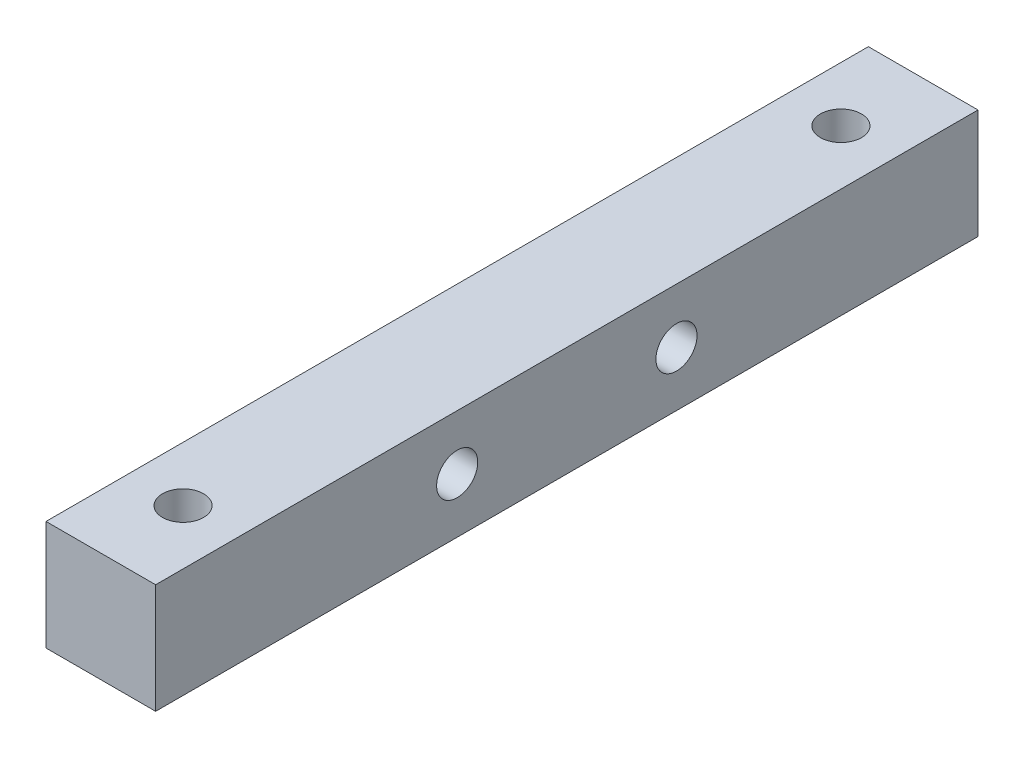
ISO-10303-21;
HEADER;
FILE_DESCRIPTION(('STEP AP214'),'2;1');
FILE_NAME('part.step','',(''),(''),'','','');
FILE_SCHEMA(('AUTOMOTIVE_DESIGN { 1 0 10303 214 1 1 1 1 }'));
ENDSEC;
DATA;
#1=APPLICATION_CONTEXT('core data for automotive mechanical design processes');
#2=APPLICATION_PROTOCOL_DEFINITION('international standard','automotive_design',2000,#1);
#3=PRODUCT_CONTEXT('',#1,'mechanical');
#4=PRODUCT('Part','Part','',(#3));
#5=PRODUCT_RELATED_PRODUCT_CATEGORY('part','',(#4));
#6=PRODUCT_DEFINITION_FORMATION('','',#4);
#7=PRODUCT_DEFINITION_CONTEXT('part definition',#1,'design');
#8=PRODUCT_DEFINITION('design','',#6,#7);
#9=PRODUCT_DEFINITION_SHAPE('','',#8);
#10=(LENGTH_UNIT() NAMED_UNIT(*) SI_UNIT(.MILLI.,.METRE.));
#11=(NAMED_UNIT(*) PLANE_ANGLE_UNIT() SI_UNIT($,.RADIAN.));
#12=(NAMED_UNIT(*) SI_UNIT($,.STERADIAN.) SOLID_ANGLE_UNIT());
#13=UNCERTAINTY_MEASURE_WITH_UNIT(LENGTH_MEASURE(1.E-05),#10,'distance_accuracy_value','');
#14=(GEOMETRIC_REPRESENTATION_CONTEXT(3) GLOBAL_UNCERTAINTY_ASSIGNED_CONTEXT((#13)) GLOBAL_UNIT_ASSIGNED_CONTEXT((#10,
#11,#12)) REPRESENTATION_CONTEXT('',''));
#15=CARTESIAN_POINT('',(0.,0.,0.));
#16=DIRECTION('',(0.,0.,1.));
#17=DIRECTION('',(1.,0.,0.));
#18=AXIS2_PLACEMENT_3D('',#15,#16,#17);
#19=CARTESIAN_POINT('',(-5.,0.,10.));
#20=DIRECTION('',(-1.,0.,0.));
#21=DIRECTION('',(0.,0.,1.));
#22=AXIS2_PLACEMENT_3D('',#19,#20,#21);
#23=CYLINDRICAL_SURFACE('',#22,1.87499999999999);
#24=CARTESIAN_POINT('',(5.,0.,10.));
#25=DIRECTION('',(-1.,0.,0.));
#26=DIRECTION('',(0.,0.,1.));
#27=AXIS2_PLACEMENT_3D('',#24,#25,#26);
#28=CIRCLE('',#27,1.875);
#29=CARTESIAN_POINT('',(5.,0.,11.875));
#30=VERTEX_POINT('',#29);
#31=EDGE_CURVE('E429',#30,#30,#28,.T.);
#32=ORIENTED_EDGE('',*,*,#31,.F.);
#33=EDGE_LOOP('',(#32));
#34=FACE_BOUND('',#33,.T.);
#35=CARTESIAN_POINT('',(-1.8,0.,10.));
#36=DIRECTION('',(-1.,0.,0.));
#37=DIRECTION('',(0.,0.,1.));
#38=AXIS2_PLACEMENT_3D('',#35,#36,#37);
#39=CIRCLE('',#38,1.87499999999999);
#40=CARTESIAN_POINT('',(-1.8,0.,11.875));
#41=VERTEX_POINT('',#40);
#42=EDGE_CURVE('E37',#41,#41,#39,.F.);
#43=ORIENTED_EDGE('',*,*,#42,.F.);
#44=EDGE_LOOP('',(#43));
#45=FACE_BOUND('',#44,.T.);
#46=ADVANCED_FACE('F33',(#34,#45),#23,.F.);
#47=CARTESIAN_POINT('',(-5.,0.,-10.));
#48=DIRECTION('',(-1.,0.,0.));
#49=DIRECTION('',(0.,0.,1.));
#50=AXIS2_PLACEMENT_3D('',#47,#48,#49);
#51=CYLINDRICAL_SURFACE('',#50,1.87499999999999);
#52=CARTESIAN_POINT('',(5.,0.,-10.));
#53=DIRECTION('',(-1.,0.,0.));
#54=DIRECTION('',(0.,0.,1.));
#55=AXIS2_PLACEMENT_3D('',#52,#53,#54);
#56=CIRCLE('',#55,1.875);
#57=CARTESIAN_POINT('',(5.,0.,-8.125));
#58=VERTEX_POINT('',#57);
#59=EDGE_CURVE('E426',#58,#58,#56,.T.);
#60=ORIENTED_EDGE('',*,*,#59,.F.);
#61=EDGE_LOOP('',(#60));
#62=FACE_BOUND('',#61,.T.);
#63=CARTESIAN_POINT('',(-1.8,0.,-10.));
#64=DIRECTION('',(-1.,0.,0.));
#65=DIRECTION('',(0.,0.,1.));
#66=AXIS2_PLACEMENT_3D('',#63,#64,#65);
#67=CIRCLE('',#66,1.87499999999999);
#68=CARTESIAN_POINT('',(-1.8,0.,-8.12500000000001));
#69=VERTEX_POINT('',#68);
#70=EDGE_CURVE('E312',#69,#69,#67,.F.);
#71=ORIENTED_EDGE('',*,*,#70,.F.);
#72=EDGE_LOOP('',(#71));
#73=FACE_BOUND('',#72,.T.);
#74=ADVANCED_FACE('F466',(#62,#73),#51,.F.);
#75=CARTESIAN_POINT('',(0.,-5.,30.));
#76=DIRECTION('',(0.,-1.,0.));
#77=DIRECTION('',(0.,0.,-1.));
#78=AXIS2_PLACEMENT_3D('',#75,#76,#77);
#79=CYLINDRICAL_SURFACE('',#78,1.87499999999999);
#80=CARTESIAN_POINT('',(0.,5.,30.));
#81=DIRECTION('',(0.,-1.,0.));
#82=DIRECTION('',(0.,0.,-1.));
#83=AXIS2_PLACEMENT_3D('',#80,#81,#82);
#84=CIRCLE('',#83,1.875);
#85=CARTESIAN_POINT('',(0.,5.,28.125));
#86=VERTEX_POINT('',#85);
#87=EDGE_CURVE('E423',#86,#86,#84,.T.);
#88=ORIENTED_EDGE('',*,*,#87,.F.);
#89=EDGE_LOOP('',(#88));
#90=FACE_BOUND('',#89,.T.);
#91=CARTESIAN_POINT('',(0.,-1.8,30.));
#92=DIRECTION('',(0.,-1.,0.));
#93=DIRECTION('',(0.,0.,-1.));
#94=AXIS2_PLACEMENT_3D('',#91,#92,#93);
#95=CIRCLE('',#94,1.87499999999999);
#96=CARTESIAN_POINT('',(0.,-1.8,28.125));
#97=VERTEX_POINT('',#96);
#98=EDGE_CURVE('E360',#97,#97,#95,.F.);
#99=ORIENTED_EDGE('',*,*,#98,.F.);
#100=EDGE_LOOP('',(#99));
#101=FACE_BOUND('',#100,.T.);
#102=ADVANCED_FACE('F468',(#90,#101),#79,.F.);
#103=CARTESIAN_POINT('',(0.,-5.,-30.));
#104=DIRECTION('',(0.,-1.,0.));
#105=DIRECTION('',(0.,0.,-1.));
#106=AXIS2_PLACEMENT_3D('',#103,#104,#105);
#107=CYLINDRICAL_SURFACE('',#106,1.87499999999999);
#108=CARTESIAN_POINT('',(0.,5.,-30.));
#109=DIRECTION('',(0.,-1.,0.));
#110=DIRECTION('',(0.,0.,-1.));
#111=AXIS2_PLACEMENT_3D('',#108,#109,#110);
#112=CIRCLE('',#111,1.875);
#113=CARTESIAN_POINT('',(0.,5.,-31.875));
#114=VERTEX_POINT('',#113);
#115=EDGE_CURVE('E420',#114,#114,#112,.T.);
#116=ORIENTED_EDGE('',*,*,#115,.F.);
#117=EDGE_LOOP('',(#116));
#118=FACE_BOUND('',#117,.T.);
#119=CARTESIAN_POINT('',(0.,-1.8,-30.));
#120=DIRECTION('',(0.,-1.,0.));
#121=DIRECTION('',(0.,0.,-1.));
#122=AXIS2_PLACEMENT_3D('',#119,#120,#121);
#123=CIRCLE('',#122,1.87499999999999);
#124=CARTESIAN_POINT('',(0.,-1.8,-31.875));
#125=VERTEX_POINT('',#124);
#126=EDGE_CURVE('E409',#125,#125,#123,.F.);
#127=ORIENTED_EDGE('',*,*,#126,.F.);
#128=EDGE_LOOP('',(#127));
#129=FACE_BOUND('',#128,.T.);
#130=ADVANCED_FACE('F475',(#118,#129),#107,.F.);
#131=CARTESIAN_POINT('',(5.,5.,37.5));
#132=DIRECTION('',(-1.,0.,0.));
#133=DIRECTION('',(0.,0.,1.));
#134=AXIS2_PLACEMENT_3D('',#131,#132,#133);
#135=PLANE('',#134);
#136=ORIENTED_EDGE('',*,*,#59,.T.);
#137=EDGE_LOOP('',(#136));
#138=FACE_BOUND('',#137,.T.);
#139=ORIENTED_EDGE('',*,*,#31,.T.);
#140=EDGE_LOOP('',(#139));
#141=FACE_BOUND('',#140,.T.);
#142=DIRECTION('',(0.,1.,0.));
#143=VECTOR('',#142,1.);
#144=CARTESIAN_POINT('',(5.,5.,-37.5));
#145=LINE('',#144,#143);
#146=CARTESIAN_POINT('',(5.,-5.,-37.5));
#147=VERTEX_POINT('',#146);
#148=CARTESIAN_POINT('',(5.,5.,-37.5));
#149=VERTEX_POINT('',#148);
#150=EDGE_CURVE('E432',#147,#149,#145,.T.);
#151=ORIENTED_EDGE('',*,*,#150,.T.);
#152=DIRECTION('',(0.,0.,-1.));
#153=VECTOR('',#152,1.);
#154=CARTESIAN_POINT('',(5.,5.,37.5));
#155=LINE('',#154,#153);
#156=CARTESIAN_POINT('',(5.,5.,37.5));
#157=VERTEX_POINT('',#156);
#158=EDGE_CURVE('E11',#157,#149,#155,.T.);
#159=ORIENTED_EDGE('',*,*,#158,.F.);
#160=DIRECTION('',(0.,1.,0.));
#161=VECTOR('',#160,1.);
#162=CARTESIAN_POINT('',(5.,5.,37.5));
#163=LINE('',#162,#161);
#164=CARTESIAN_POINT('',(5.,-5.,37.5));
#165=VERTEX_POINT('',#164);
#166=EDGE_CURVE('E433',#165,#157,#163,.T.);
#167=ORIENTED_EDGE('',*,*,#166,.F.);
#168=DIRECTION('',(0.,0.,-1.));
#169=VECTOR('',#168,1.);
#170=CARTESIAN_POINT('',(5.,-5.,37.5));
#171=LINE('',#170,#169);
#172=EDGE_CURVE('E443',#165,#147,#171,.T.);
#173=ORIENTED_EDGE('',*,*,#172,.T.);
#174=EDGE_LOOP('',(#151,#159,#167,#173));
#175=FACE_BOUND('',#174,.T.);
#176=ADVANCED_FACE('F35',(#138,#141,#175),#135,.F.);
#177=CARTESIAN_POINT('',(-5.,5.,37.5));
#178=DIRECTION('',(0.,-1.,0.));
#179=DIRECTION('',(0.,0.,-1.));
#180=AXIS2_PLACEMENT_3D('',#177,#178,#179);
#181=PLANE('',#180);
#182=ORIENTED_EDGE('',*,*,#115,.T.);
#183=EDGE_LOOP('',(#182));
#184=FACE_BOUND('',#183,.T.);
#185=ORIENTED_EDGE('',*,*,#87,.T.);
#186=EDGE_LOOP('',(#185));
#187=FACE_BOUND('',#186,.T.);
#188=DIRECTION('',(-1.,0.,0.));
#189=VECTOR('',#188,1.);
#190=CARTESIAN_POINT('',(-5.,5.,-37.5));
#191=LINE('',#190,#189);
#192=CARTESIAN_POINT('',(-5.,5.,-37.5));
#193=VERTEX_POINT('',#192);
#194=EDGE_CURVE('E446',#149,#193,#191,.T.);
#195=ORIENTED_EDGE('',*,*,#194,.T.);
#196=DIRECTION('',(0.,0.,-1.));
#197=VECTOR('',#196,1.);
#198=CARTESIAN_POINT('',(-5.,5.,37.5));
#199=LINE('',#198,#197);
#200=CARTESIAN_POINT('',(-5.,5.,37.5));
#201=VERTEX_POINT('',#200);
#202=EDGE_CURVE('E42',#201,#193,#199,.T.);
#203=ORIENTED_EDGE('',*,*,#202,.F.);
#204=DIRECTION('',(-1.,0.,0.));
#205=VECTOR('',#204,1.);
#206=CARTESIAN_POINT('',(-5.,5.,37.5));
#207=LINE('',#206,#205);
#208=EDGE_CURVE('E436',#157,#201,#207,.T.);
#209=ORIENTED_EDGE('',*,*,#208,.F.);
#210=ORIENTED_EDGE('',*,*,#158,.T.);
#211=EDGE_LOOP('',(#195,#203,#209,#210));
#212=FACE_BOUND('',#211,.T.);
#213=ADVANCED_FACE('F498',(#184,#187,#212),#181,.F.);
#214=CARTESIAN_POINT('',(-5.,5.,37.5));
#215=DIRECTION('',(1.,0.,0.));
#216=DIRECTION('',(0.,1.,0.));
#217=AXIS2_PLACEMENT_3D('',#214,#215,#216);
#218=PLANE('',#217);
#219=DIRECTION('',(0.,0.866025403784438,0.500000000000001));
#220=VECTOR('',#219,1.);
#221=CARTESIAN_POINT('',(-5.,-2.77128129211021,11.6));
#222=LINE('',#221,#220);
#223=CARTESIAN_POINT('',(-5.,-2.77128129211021,11.6));
#224=VERTEX_POINT('',#223);
#225=CARTESIAN_POINT('',(-5.,0.,13.2));
#226=VERTEX_POINT('',#225);
#227=EDGE_CURVE('E256',#224,#226,#222,.T.);
#228=ORIENTED_EDGE('',*,*,#227,.F.);
#229=DIRECTION('',(0.,0.,1.));
#230=VECTOR('',#229,1.);
#231=CARTESIAN_POINT('',(-5.,-2.77128129211021,8.4));
#232=LINE('',#231,#230);
#233=CARTESIAN_POINT('',(-5.,-2.77128129211021,8.4));
#234=VERTEX_POINT('',#233);
#235=EDGE_CURVE('E50',#234,#224,#232,.T.);
#236=ORIENTED_EDGE('',*,*,#235,.F.);
#237=DIRECTION('',(0.,-0.866025403784439,0.5));
#238=VECTOR('',#237,1.);
#239=CARTESIAN_POINT('',(-5.,0.,6.8));
#240=LINE('',#239,#238);
#241=CARTESIAN_POINT('',(-5.,0.,6.8));
#242=VERTEX_POINT('',#241);
#243=EDGE_CURVE('E242',#242,#234,#240,.T.);
#244=ORIENTED_EDGE('',*,*,#243,.F.);
#245=DIRECTION('',(0.,-0.866025403784439,-0.5));
#246=VECTOR('',#245,1.);
#247=CARTESIAN_POINT('',(-5.,2.7712812921102,8.4));
#248=LINE('',#247,#246);
#249=CARTESIAN_POINT('',(-5.,2.7712812921102,8.4));
#250=VERTEX_POINT('',#249);
#251=EDGE_CURVE('E245',#250,#242,#248,.T.);
#252=ORIENTED_EDGE('',*,*,#251,.F.);
#253=DIRECTION('',(0.,0.,-1.));
#254=VECTOR('',#253,1.);
#255=CARTESIAN_POINT('',(-5.,2.7712812921102,11.6));
#256=LINE('',#255,#254);
#257=CARTESIAN_POINT('',(-5.,2.7712812921102,11.6));
#258=VERTEX_POINT('',#257);
#259=EDGE_CURVE('E261',#258,#250,#256,.T.);
#260=ORIENTED_EDGE('',*,*,#259,.F.);
#261=DIRECTION('',(0.,0.866025403784439,-0.5));
#262=VECTOR('',#261,1.);
#263=CARTESIAN_POINT('',(-5.,0.,13.2));
#264=LINE('',#263,#262);
#265=EDGE_CURVE('E258',#226,#258,#264,.T.);
#266=ORIENTED_EDGE('',*,*,#265,.F.);
#267=EDGE_LOOP('',(#228,#236,#244,#252,#260,#266));
#268=FACE_BOUND('',#267,.T.);
#269=DIRECTION('',(0.,0.866025403784438,0.5));
#270=VECTOR('',#269,1.);
#271=CARTESIAN_POINT('',(-5.,-2.77128129211021,-8.4));
#272=LINE('',#271,#270);
#273=CARTESIAN_POINT('',(-5.,-2.77128129211021,-8.4));
#274=VERTEX_POINT('',#273);
#275=CARTESIAN_POINT('',(-5.,0.,-6.8));
#276=VERTEX_POINT('',#275);
#277=EDGE_CURVE('E296',#274,#276,#272,.T.);
#278=ORIENTED_EDGE('',*,*,#277,.F.);
#279=DIRECTION('',(0.,0.,1.));
#280=VECTOR('',#279,1.);
#281=CARTESIAN_POINT('',(-5.,-2.77128129211021,-11.6));
#282=LINE('',#281,#280);
#283=CARTESIAN_POINT('',(-5.,-2.77128129211021,-11.6));
#284=VERTEX_POINT('',#283);
#285=EDGE_CURVE('E58',#284,#274,#282,.T.);
#286=ORIENTED_EDGE('',*,*,#285,.F.);
#287=DIRECTION('',(0.,-0.866025403784438,0.500000000000001));
#288=VECTOR('',#287,1.);
#289=CARTESIAN_POINT('',(-5.,0.,-13.2));
#290=LINE('',#289,#288);
#291=CARTESIAN_POINT('',(-5.,0.,-13.2));
#292=VERTEX_POINT('',#291);
#293=EDGE_CURVE('E279',#292,#284,#290,.T.);
#294=ORIENTED_EDGE('',*,*,#293,.F.);
#295=DIRECTION('',(0.,-0.866025403784438,-0.500000000000001));
#296=VECTOR('',#295,1.);
#297=CARTESIAN_POINT('',(-5.,2.7712812921102,-11.6));
#298=LINE('',#297,#296);
#299=CARTESIAN_POINT('',(-5.,2.7712812921102,-11.6));
#300=VERTEX_POINT('',#299);
#301=EDGE_CURVE('E305',#300,#292,#298,.T.);
#302=ORIENTED_EDGE('',*,*,#301,.F.);
#303=DIRECTION('',(0.,0.,-1.));
#304=VECTOR('',#303,1.);
#305=CARTESIAN_POINT('',(-5.,2.7712812921102,-8.4));
#306=LINE('',#305,#304);
#307=CARTESIAN_POINT('',(-5.,2.7712812921102,-8.4));
#308=VERTEX_POINT('',#307);
#309=EDGE_CURVE('E302',#308,#300,#306,.T.);
#310=ORIENTED_EDGE('',*,*,#309,.F.);
#311=DIRECTION('',(0.,0.866025403784439,-0.5));
#312=VECTOR('',#311,1.);
#313=CARTESIAN_POINT('',(-5.,0.,-6.8));
#314=LINE('',#313,#312);
#315=EDGE_CURVE('E299',#276,#308,#314,.T.);
#316=ORIENTED_EDGE('',*,*,#315,.F.);
#317=EDGE_LOOP('',(#278,#286,#294,#302,#310,#316));
#318=FACE_BOUND('',#317,.T.);
#319=DIRECTION('',(0.,-1.,0.));
#320=VECTOR('',#319,1.);
#321=CARTESIAN_POINT('',(-5.,5.,-37.5));
#322=LINE('',#321,#320);
#323=CARTESIAN_POINT('',(-5.,-5.,-37.5));
#324=VERTEX_POINT('',#323);
#325=EDGE_CURVE('E448',#193,#324,#322,.T.);
#326=ORIENTED_EDGE('',*,*,#325,.T.);
#327=DIRECTION('',(0.,0.,-1.));
#328=VECTOR('',#327,1.);
#329=CARTESIAN_POINT('',(-5.,-5.,37.5));
#330=LINE('',#329,#328);
#331=CARTESIAN_POINT('',(-5.,-5.,37.5));
#332=VERTEX_POINT('',#331);
#333=EDGE_CURVE('E453',#332,#324,#330,.T.);
#334=ORIENTED_EDGE('',*,*,#333,.F.);
#335=DIRECTION('',(0.,-1.,0.));
#336=VECTOR('',#335,1.);
#337=CARTESIAN_POINT('',(-5.,5.,37.5));
#338=LINE('',#337,#336);
#339=EDGE_CURVE('E439',#201,#332,#338,.T.);
#340=ORIENTED_EDGE('',*,*,#339,.F.);
#341=ORIENTED_EDGE('',*,*,#202,.T.);
#342=EDGE_LOOP('',(#326,#334,#340,#341));
#343=FACE_BOUND('',#342,.T.);
#344=ADVANCED_FACE('F495',(#268,#318,#343),#218,.F.);
#345=CARTESIAN_POINT('',(-5.,-5.,37.5));
#346=DIRECTION('',(0.,1.,0.));
#347=DIRECTION('',(0.,0.,1.));
#348=AXIS2_PLACEMENT_3D('',#345,#346,#347);
#349=PLANE('',#348);
#350=DIRECTION('',(-0.866025403784438,0.,0.5));
#351=VECTOR('',#350,1.);
#352=CARTESIAN_POINT('',(2.7712812921102,-5.,31.6));
#353=LINE('',#352,#351);
#354=CARTESIAN_POINT('',(2.7712812921102,-5.,31.6));
#355=VERTEX_POINT('',#354);
#356=CARTESIAN_POINT('',(0.,-5.,33.2));
#357=VERTEX_POINT('',#356);
#358=EDGE_CURVE('E344',#355,#357,#353,.T.);
#359=ORIENTED_EDGE('',*,*,#358,.F.);
#360=DIRECTION('',(0.,0.,1.));
#361=VECTOR('',#360,1.);
#362=CARTESIAN_POINT('',(2.7712812921102,-5.,28.4));
#363=LINE('',#362,#361);
#364=CARTESIAN_POINT('',(2.7712812921102,-5.,28.4));
#365=VERTEX_POINT('',#364);
#366=EDGE_CURVE('E342',#365,#355,#363,.T.);
#367=ORIENTED_EDGE('',*,*,#366,.F.);
#368=DIRECTION('',(0.86602540378444,0.,0.499999999999998));
#369=VECTOR('',#368,1.);
#370=CARTESIAN_POINT('',(0.,-5.,26.8));
#371=LINE('',#370,#369);
#372=CARTESIAN_POINT('',(0.,-5.,26.8));
#373=VERTEX_POINT('',#372);
#374=EDGE_CURVE('E326',#373,#365,#371,.T.);
#375=ORIENTED_EDGE('',*,*,#374,.F.);
#376=DIRECTION('',(0.866025403784439,0.,-0.499999999999999));
#377=VECTOR('',#376,1.);
#378=CARTESIAN_POINT('',(-2.77128129211022,-5.,28.4));
#379=LINE('',#378,#377);
#380=CARTESIAN_POINT('',(-2.77128129211022,-5.,28.4));
#381=VERTEX_POINT('',#380);
#382=EDGE_CURVE('E353',#381,#373,#379,.T.);
#383=ORIENTED_EDGE('',*,*,#382,.F.);
#384=DIRECTION('',(0.,0.,-1.));
#385=VECTOR('',#384,1.);
#386=CARTESIAN_POINT('',(-2.77128129211021,-5.,31.6));
#387=LINE('',#386,#385);
#388=CARTESIAN_POINT('',(-2.77128129211021,-5.,31.6));
#389=VERTEX_POINT('',#388);
#390=EDGE_CURVE('E350',#389,#381,#387,.T.);
#391=ORIENTED_EDGE('',*,*,#390,.F.);
#392=DIRECTION('',(-0.866025403784438,0.,-0.500000000000002));
#393=VECTOR('',#392,1.);
#394=CARTESIAN_POINT('',(0.,-5.,33.2));
#395=LINE('',#394,#393);
#396=EDGE_CURVE('E347',#357,#389,#395,.T.);
#397=ORIENTED_EDGE('',*,*,#396,.F.);
#398=EDGE_LOOP('',(#359,#367,#375,#383,#391,#397));
#399=FACE_BOUND('',#398,.T.);
#400=DIRECTION('',(-0.866025403784438,0.,0.5));
#401=VECTOR('',#400,1.);
#402=CARTESIAN_POINT('',(2.77128129211021,-5.,-28.4));
#403=LINE('',#402,#401);
#404=CARTESIAN_POINT('',(2.77128129211021,-5.,-28.4));
#405=VERTEX_POINT('',#404);
#406=CARTESIAN_POINT('',(0.,-5.,-26.8));
#407=VERTEX_POINT('',#406);
#408=EDGE_CURVE('E393',#405,#407,#403,.T.);
#409=ORIENTED_EDGE('',*,*,#408,.F.);
#410=DIRECTION('',(0.,0.,1.));
#411=VECTOR('',#410,1.);
#412=CARTESIAN_POINT('',(2.77128129211021,-5.,-31.6));
#413=LINE('',#412,#411);
#414=CARTESIAN_POINT('',(2.77128129211021,-5.,-31.6));
#415=VERTEX_POINT('',#414);
#416=EDGE_CURVE('E391',#415,#405,#413,.T.);
#417=ORIENTED_EDGE('',*,*,#416,.F.);
#418=DIRECTION('',(0.866025403784438,0.,0.500000000000001));
#419=VECTOR('',#418,1.);
#420=CARTESIAN_POINT('',(0.,-5.,-33.2));
#421=LINE('',#420,#419);
#422=CARTESIAN_POINT('',(0.,-5.,-33.2));
#423=VERTEX_POINT('',#422);
#424=EDGE_CURVE('E375',#423,#415,#421,.T.);
#425=ORIENTED_EDGE('',*,*,#424,.F.);
#426=DIRECTION('',(0.866025403784438,0.,-0.5));
#427=VECTOR('',#426,1.);
#428=CARTESIAN_POINT('',(-2.77128129211019,-5.,-31.6));
#429=LINE('',#428,#427);
#430=CARTESIAN_POINT('',(-2.77128129211019,-5.,-31.6));
#431=VERTEX_POINT('',#430);
#432=EDGE_CURVE('E402',#431,#423,#429,.T.);
#433=ORIENTED_EDGE('',*,*,#432,.F.);
#434=DIRECTION('',(0.,0.,-1.));
#435=VECTOR('',#434,1.);
#436=CARTESIAN_POINT('',(-2.77128129211019,-5.,-28.4));
#437=LINE('',#436,#435);
#438=CARTESIAN_POINT('',(-2.77128129211019,-5.,-28.4));
#439=VERTEX_POINT('',#438);
#440=EDGE_CURVE('E399',#439,#431,#437,.T.);
#441=ORIENTED_EDGE('',*,*,#440,.F.);
#442=DIRECTION('',(-0.866025403784439,0.,-0.5));
#443=VECTOR('',#442,1.);
#444=CARTESIAN_POINT('',(0.,-5.,-26.8));
#445=LINE('',#444,#443);
#446=EDGE_CURVE('E396',#407,#439,#445,.T.);
#447=ORIENTED_EDGE('',*,*,#446,.F.);
#448=EDGE_LOOP('',(#409,#417,#425,#433,#441,#447));
#449=FACE_BOUND('',#448,.T.);
#450=DIRECTION('',(1.,0.,0.));
#451=VECTOR('',#450,1.);
#452=CARTESIAN_POINT('',(-5.,-5.,-37.5));
#453=LINE('',#452,#451);
#454=EDGE_CURVE('E437',#324,#147,#453,.T.);
#455=ORIENTED_EDGE('',*,*,#454,.T.);
#456=ORIENTED_EDGE('',*,*,#172,.F.);
#457=DIRECTION('',(1.,0.,0.));
#458=VECTOR('',#457,1.);
#459=CARTESIAN_POINT('',(-5.,-5.,37.5));
#460=LINE('',#459,#458);
#461=EDGE_CURVE('E441',#332,#165,#460,.T.);
#462=ORIENTED_EDGE('',*,*,#461,.F.);
#463=ORIENTED_EDGE('',*,*,#333,.T.);
#464=EDGE_LOOP('',(#455,#456,#462,#463));
#465=FACE_BOUND('',#464,.T.);
#466=ADVANCED_FACE('F487',(#399,#449,#465),#349,.F.);
#467=CARTESIAN_POINT('',(0.,0.,37.5));
#468=DIRECTION('',(0.,0.,1.));
#469=DIRECTION('',(1.,0.,0.));
#470=AXIS2_PLACEMENT_3D('',#467,#468,#469);
#471=PLANE('',#470);
#472=ORIENTED_EDGE('',*,*,#166,.T.);
#473=ORIENTED_EDGE('',*,*,#208,.T.);
#474=ORIENTED_EDGE('',*,*,#339,.T.);
#475=ORIENTED_EDGE('',*,*,#461,.T.);
#476=EDGE_LOOP('',(#472,#473,#474,#475));
#477=FACE_BOUND('',#476,.T.);
#478=ADVANCED_FACE('F483',(#477),#471,.T.);
#479=CARTESIAN_POINT('',(0.,0.,-37.5));
#480=DIRECTION('',(0.,0.,1.));
#481=DIRECTION('',(1.,0.,0.));
#482=AXIS2_PLACEMENT_3D('',#479,#480,#481);
#483=PLANE('',#482);
#484=ORIENTED_EDGE('',*,*,#150,.F.);
#485=ORIENTED_EDGE('',*,*,#454,.F.);
#486=ORIENTED_EDGE('',*,*,#325,.F.);
#487=ORIENTED_EDGE('',*,*,#194,.F.);
#488=EDGE_LOOP('',(#484,#485,#486,#487));
#489=FACE_BOUND('',#488,.T.);
#490=ADVANCED_FACE('F486',(#489),#483,.F.);
#491=CARTESIAN_POINT('',(0.,-1.8,0.));
#492=DIRECTION('',(0.,-1.,0.));
#493=DIRECTION('',(0.,0.,-1.));
#494=AXIS2_PLACEMENT_3D('',#491,#492,#493);
#495=PLANE('',#494);
#496=DIRECTION('',(0.,0.,1.));
#497=VECTOR('',#496,1.);
#498=CARTESIAN_POINT('',(2.77128129211021,-1.8,-31.6));
#499=LINE('',#498,#497);
#500=CARTESIAN_POINT('',(2.77128129211021,-1.8,-31.6));
#501=VERTEX_POINT('',#500);
#502=CARTESIAN_POINT('',(2.77128129211021,-1.8,-28.4));
#503=VERTEX_POINT('',#502);
#504=EDGE_CURVE('E371',#501,#503,#499,.T.);
#505=ORIENTED_EDGE('',*,*,#504,.T.);
#506=DIRECTION('',(-0.866025403784438,0.,0.5));
#507=VECTOR('',#506,1.);
#508=CARTESIAN_POINT('',(2.77128129211021,-1.8,-28.4));
#509=LINE('',#508,#507);
#510=CARTESIAN_POINT('',(0.,-1.8,-26.8));
#511=VERTEX_POINT('',#510);
#512=EDGE_CURVE('E374',#503,#511,#509,.T.);
#513=ORIENTED_EDGE('',*,*,#512,.T.);
#514=DIRECTION('',(-0.866025403784439,0.,-0.5));
#515=VECTOR('',#514,1.);
#516=CARTESIAN_POINT('',(0.,-1.8,-26.8));
#517=LINE('',#516,#515);
#518=CARTESIAN_POINT('',(-2.77128129211019,-1.8,-28.4));
#519=VERTEX_POINT('',#518);
#520=EDGE_CURVE('E378',#511,#519,#517,.T.);
#521=ORIENTED_EDGE('',*,*,#520,.T.);
#522=DIRECTION('',(0.,0.,-1.));
#523=VECTOR('',#522,1.);
#524=CARTESIAN_POINT('',(-2.77128129211019,-1.8,-28.4));
#525=LINE('',#524,#523);
#526=CARTESIAN_POINT('',(-2.77128129211019,-1.8,-31.6));
#527=VERTEX_POINT('',#526);
#528=EDGE_CURVE('E381',#519,#527,#525,.T.);
#529=ORIENTED_EDGE('',*,*,#528,.T.);
#530=DIRECTION('',(0.866025403784438,0.,-0.5));
#531=VECTOR('',#530,1.);
#532=CARTESIAN_POINT('',(-2.77128129211019,-1.8,-31.6));
#533=LINE('',#532,#531);
#534=CARTESIAN_POINT('',(0.,-1.8,-33.2));
#535=VERTEX_POINT('',#534);
#536=EDGE_CURVE('E384',#527,#535,#533,.T.);
#537=ORIENTED_EDGE('',*,*,#536,.T.);
#538=DIRECTION('',(0.866025403784438,0.,0.500000000000001));
#539=VECTOR('',#538,1.);
#540=CARTESIAN_POINT('',(0.,-1.8,-33.2));
#541=LINE('',#540,#539);
#542=EDGE_CURVE('E387',#535,#501,#541,.T.);
#543=ORIENTED_EDGE('',*,*,#542,.T.);
#544=EDGE_LOOP('',(#505,#513,#521,#529,#537,#543));
#545=FACE_BOUND('',#544,.T.);
#546=ORIENTED_EDGE('',*,*,#126,.T.);
#547=EDGE_LOOP('',(#546));
#548=FACE_BOUND('',#547,.T.);
#549=ADVANCED_FACE('F491',(#545,#548),#495,.T.);
#550=CARTESIAN_POINT('',(2.77128129211021,-1.8,-31.6));
#551=DIRECTION('',(1.,0.,0.));
#552=DIRECTION('',(0.,0.,-1.));
#553=AXIS2_PLACEMENT_3D('',#550,#551,#552);
#554=PLANE('',#553);
#555=ORIENTED_EDGE('',*,*,#416,.T.);
#556=DIRECTION('',(0.,-1.,0.));
#557=VECTOR('',#556,1.);
#558=CARTESIAN_POINT('',(2.77128129211021,-1.8,-28.4));
#559=LINE('',#558,#557);
#560=EDGE_CURVE('E390',#503,#405,#559,.T.);
#561=ORIENTED_EDGE('',*,*,#560,.F.);
#562=ORIENTED_EDGE('',*,*,#504,.F.);
#563=DIRECTION('',(0.,-1.,0.));
#564=VECTOR('',#563,1.);
#565=CARTESIAN_POINT('',(2.77128129211021,-1.8,-31.6));
#566=LINE('',#565,#564);
#567=EDGE_CURVE('E407',#501,#415,#566,.T.);
#568=ORIENTED_EDGE('',*,*,#567,.T.);
#569=EDGE_LOOP('',(#555,#561,#562,#568));
#570=FACE_BOUND('',#569,.T.);
#571=ADVANCED_FACE('F567',(#570),#554,.F.);
#572=CARTESIAN_POINT('',(0.,-1.8,-33.2));
#573=DIRECTION('',(0.500000000000001,0.,-0.866025403784438));
#574=DIRECTION('',(-0.866025403784438,0.,-0.500000000000001));
#575=AXIS2_PLACEMENT_3D('',#572,#573,#574);
#576=PLANE('',#575);
#577=ORIENTED_EDGE('',*,*,#424,.T.);
#578=ORIENTED_EDGE('',*,*,#567,.F.);
#579=ORIENTED_EDGE('',*,*,#542,.F.);
#580=DIRECTION('',(0.,-1.,0.));
#581=VECTOR('',#580,1.);
#582=CARTESIAN_POINT('',(0.,-1.8,-33.2));
#583=LINE('',#582,#581);
#584=EDGE_CURVE('E410',#535,#423,#583,.T.);
#585=ORIENTED_EDGE('',*,*,#584,.T.);
#586=EDGE_LOOP('',(#577,#578,#579,#585));
#587=FACE_BOUND('',#586,.T.);
#588=ADVANCED_FACE('F569',(#587),#576,.F.);
#589=CARTESIAN_POINT('',(-2.77128129211019,-1.8,-31.6));
#590=DIRECTION('',(-0.5,0.,-0.866025403784438));
#591=DIRECTION('',(-0.866025403784439,0.,0.5));
#592=AXIS2_PLACEMENT_3D('',#589,#590,#591);
#593=PLANE('',#592);
#594=ORIENTED_EDGE('',*,*,#432,.T.);
#595=ORIENTED_EDGE('',*,*,#584,.F.);
#596=ORIENTED_EDGE('',*,*,#536,.F.);
#597=DIRECTION('',(0.,-1.,0.));
#598=VECTOR('',#597,1.);
#599=CARTESIAN_POINT('',(-2.77128129211019,-1.8,-31.6));
#600=LINE('',#599,#598);
#601=EDGE_CURVE('E412',#527,#431,#600,.T.);
#602=ORIENTED_EDGE('',*,*,#601,.T.);
#603=EDGE_LOOP('',(#594,#595,#596,#602));
#604=FACE_BOUND('',#603,.T.);
#605=ADVANCED_FACE('F572',(#604),#593,.F.);
#606=CARTESIAN_POINT('',(-2.77128129211019,-1.8,-28.4));
#607=DIRECTION('',(-1.,0.,0.));
#608=DIRECTION('',(0.,0.,1.));
#609=AXIS2_PLACEMENT_3D('',#606,#607,#608);
#610=PLANE('',#609);
#611=ORIENTED_EDGE('',*,*,#440,.T.);
#612=ORIENTED_EDGE('',*,*,#601,.F.);
#613=ORIENTED_EDGE('',*,*,#528,.F.);
#614=DIRECTION('',(0.,-1.,0.));
#615=VECTOR('',#614,1.);
#616=CARTESIAN_POINT('',(-2.77128129211019,-1.8,-28.4));
#617=LINE('',#616,#615);
#618=EDGE_CURVE('E414',#519,#439,#617,.T.);
#619=ORIENTED_EDGE('',*,*,#618,.T.);
#620=EDGE_LOOP('',(#611,#612,#613,#619));
#621=FACE_BOUND('',#620,.T.);
#622=ADVANCED_FACE('F576',(#621),#610,.F.);
#623=CARTESIAN_POINT('',(0.,-1.8,-26.8));
#624=DIRECTION('',(-0.5,0.,0.866025403784439));
#625=DIRECTION('',(0.866025403784439,0.,0.5));
#626=AXIS2_PLACEMENT_3D('',#623,#624,#625);
#627=PLANE('',#626);
#628=ORIENTED_EDGE('',*,*,#446,.T.);
#629=ORIENTED_EDGE('',*,*,#618,.F.);
#630=ORIENTED_EDGE('',*,*,#520,.F.);
#631=DIRECTION('',(0.,-1.,0.));
#632=VECTOR('',#631,1.);
#633=CARTESIAN_POINT('',(0.,-1.8,-26.8));
#634=LINE('',#633,#632);
#635=EDGE_CURVE('E416',#511,#407,#634,.T.);
#636=ORIENTED_EDGE('',*,*,#635,.T.);
#637=EDGE_LOOP('',(#628,#629,#630,#636));
#638=FACE_BOUND('',#637,.T.);
#639=ADVANCED_FACE('F539',(#638),#627,.F.);
#640=CARTESIAN_POINT('',(2.77128129211021,-1.8,-28.4));
#641=DIRECTION('',(0.5,0.,0.866025403784438));
#642=DIRECTION('',(0.866025403784439,0.,-0.5));
#643=AXIS2_PLACEMENT_3D('',#640,#641,#642);
#644=PLANE('',#643);
#645=ORIENTED_EDGE('',*,*,#408,.T.);
#646=ORIENTED_EDGE('',*,*,#635,.F.);
#647=ORIENTED_EDGE('',*,*,#512,.F.);
#648=ORIENTED_EDGE('',*,*,#560,.T.);
#649=EDGE_LOOP('',(#645,#646,#647,#648));
#650=FACE_BOUND('',#649,.T.);
#651=ADVANCED_FACE('F529',(#650),#644,.F.);
#652=CARTESIAN_POINT('',(0.,-1.8,0.));
#653=DIRECTION('',(0.,-1.,0.));
#654=DIRECTION('',(0.,0.,-1.));
#655=AXIS2_PLACEMENT_3D('',#652,#653,#654);
#656=PLANE('',#655);
#657=DIRECTION('',(0.,0.,1.));
#658=VECTOR('',#657,1.);
#659=CARTESIAN_POINT('',(2.7712812921102,-1.8,28.4));
#660=LINE('',#659,#658);
#661=CARTESIAN_POINT('',(2.7712812921102,-1.8,28.4));
#662=VERTEX_POINT('',#661);
#663=CARTESIAN_POINT('',(2.7712812921102,-1.8,31.6));
#664=VERTEX_POINT('',#663);
#665=EDGE_CURVE('E322',#662,#664,#660,.T.);
#666=ORIENTED_EDGE('',*,*,#665,.T.);
#667=DIRECTION('',(-0.866025403784438,0.,0.5));
#668=VECTOR('',#667,1.);
#669=CARTESIAN_POINT('',(2.7712812921102,-1.8,31.6));
#670=LINE('',#669,#668);
#671=CARTESIAN_POINT('',(0.,-1.8,33.2));
#672=VERTEX_POINT('',#671);
#673=EDGE_CURVE('E325',#664,#672,#670,.T.);
#674=ORIENTED_EDGE('',*,*,#673,.T.);
#675=DIRECTION('',(-0.866025403784438,0.,-0.500000000000002));
#676=VECTOR('',#675,1.);
#677=CARTESIAN_POINT('',(0.,-1.8,33.2));
#678=LINE('',#677,#676);
#679=CARTESIAN_POINT('',(-2.77128129211021,-1.8,31.6));
#680=VERTEX_POINT('',#679);
#681=EDGE_CURVE('E329',#672,#680,#678,.T.);
#682=ORIENTED_EDGE('',*,*,#681,.T.);
#683=DIRECTION('',(0.,0.,-1.));
#684=VECTOR('',#683,1.);
#685=CARTESIAN_POINT('',(-2.77128129211021,-1.8,31.6));
#686=LINE('',#685,#684);
#687=CARTESIAN_POINT('',(-2.77128129211022,-1.8,28.4));
#688=VERTEX_POINT('',#687);
#689=EDGE_CURVE('E332',#680,#688,#686,.T.);
#690=ORIENTED_EDGE('',*,*,#689,.T.);
#691=DIRECTION('',(0.866025403784439,0.,-0.499999999999999));
#692=VECTOR('',#691,1.);
#693=CARTESIAN_POINT('',(-2.77128129211022,-1.8,28.4));
#694=LINE('',#693,#692);
#695=CARTESIAN_POINT('',(0.,-1.8,26.8));
#696=VERTEX_POINT('',#695);
#697=EDGE_CURVE('E335',#688,#696,#694,.T.);
#698=ORIENTED_EDGE('',*,*,#697,.T.);
#699=DIRECTION('',(0.86602540378444,0.,0.499999999999998));
#700=VECTOR('',#699,1.);
#701=CARTESIAN_POINT('',(0.,-1.8,26.8));
#702=LINE('',#701,#700);
#703=EDGE_CURVE('E338',#696,#662,#702,.T.);
#704=ORIENTED_EDGE('',*,*,#703,.T.);
#705=EDGE_LOOP('',(#666,#674,#682,#690,#698,#704));
#706=FACE_BOUND('',#705,.T.);
#707=ORIENTED_EDGE('',*,*,#98,.T.);
#708=EDGE_LOOP('',(#707));
#709=FACE_BOUND('',#708,.T.);
#710=ADVANCED_FACE('F526',(#706,#709),#656,.T.);
#711=CARTESIAN_POINT('',(2.7712812921102,-1.8,28.4));
#712=DIRECTION('',(1.,0.,0.));
#713=DIRECTION('',(0.,0.,-1.));
#714=AXIS2_PLACEMENT_3D('',#711,#712,#713);
#715=PLANE('',#714);
#716=ORIENTED_EDGE('',*,*,#366,.T.);
#717=DIRECTION('',(0.,-1.,0.));
#718=VECTOR('',#717,1.);
#719=CARTESIAN_POINT('',(2.7712812921102,-1.8,31.6));
#720=LINE('',#719,#718);
#721=EDGE_CURVE('E341',#664,#355,#720,.T.);
#722=ORIENTED_EDGE('',*,*,#721,.F.);
#723=ORIENTED_EDGE('',*,*,#665,.F.);
#724=DIRECTION('',(0.,-1.,0.));
#725=VECTOR('',#724,1.);
#726=CARTESIAN_POINT('',(2.7712812921102,-1.8,28.4));
#727=LINE('',#726,#725);
#728=EDGE_CURVE('E358',#662,#365,#727,.T.);
#729=ORIENTED_EDGE('',*,*,#728,.T.);
#730=EDGE_LOOP('',(#716,#722,#723,#729));
#731=FACE_BOUND('',#730,.T.);
#732=ADVANCED_FACE('F528',(#731),#715,.F.);
#733=CARTESIAN_POINT('',(0.,-1.8,26.8));
#734=DIRECTION('',(0.499999999999998,0.,-0.86602540378444));
#735=DIRECTION('',(-0.86602540378444,0.,-0.499999999999998));
#736=AXIS2_PLACEMENT_3D('',#733,#734,#735);
#737=PLANE('',#736);
#738=ORIENTED_EDGE('',*,*,#374,.T.);
#739=ORIENTED_EDGE('',*,*,#728,.F.);
#740=ORIENTED_EDGE('',*,*,#703,.F.);
#741=DIRECTION('',(0.,-1.,0.));
#742=VECTOR('',#741,1.);
#743=CARTESIAN_POINT('',(0.,-1.8,26.8));
#744=LINE('',#743,#742);
#745=EDGE_CURVE('E361',#696,#373,#744,.T.);
#746=ORIENTED_EDGE('',*,*,#745,.T.);
#747=EDGE_LOOP('',(#738,#739,#740,#746));
#748=FACE_BOUND('',#747,.T.);
#749=ADVANCED_FACE('F536',(#748),#737,.F.);
#750=CARTESIAN_POINT('',(-2.77128129211022,-1.8,28.4));
#751=DIRECTION('',(-0.499999999999999,0.,-0.866025403784439));
#752=DIRECTION('',(-0.866025403784439,0.,0.499999999999999));
#753=AXIS2_PLACEMENT_3D('',#750,#751,#752);
#754=PLANE('',#753);
#755=ORIENTED_EDGE('',*,*,#382,.T.);
#756=ORIENTED_EDGE('',*,*,#745,.F.);
#757=ORIENTED_EDGE('',*,*,#697,.F.);
#758=DIRECTION('',(0.,-1.,0.));
#759=VECTOR('',#758,1.);
#760=CARTESIAN_POINT('',(-2.77128129211022,-1.8,28.4));
#761=LINE('',#760,#759);
#762=EDGE_CURVE('E363',#688,#381,#761,.T.);
#763=ORIENTED_EDGE('',*,*,#762,.T.);
#764=EDGE_LOOP('',(#755,#756,#757,#763));
#765=FACE_BOUND('',#764,.T.);
#766=ADVANCED_FACE('F548',(#765),#754,.F.);
#767=CARTESIAN_POINT('',(-2.77128129211021,-1.8,31.6));
#768=DIRECTION('',(-1.,0.,0.));
#769=DIRECTION('',(0.,0.,1.));
#770=AXIS2_PLACEMENT_3D('',#767,#768,#769);
#771=PLANE('',#770);
#772=ORIENTED_EDGE('',*,*,#390,.T.);
#773=ORIENTED_EDGE('',*,*,#762,.F.);
#774=ORIENTED_EDGE('',*,*,#689,.F.);
#775=DIRECTION('',(0.,-1.,0.));
#776=VECTOR('',#775,1.);
#777=CARTESIAN_POINT('',(-2.77128129211021,-1.8,31.6));
#778=LINE('',#777,#776);
#779=EDGE_CURVE('E365',#680,#389,#778,.T.);
#780=ORIENTED_EDGE('',*,*,#779,.T.);
#781=EDGE_LOOP('',(#772,#773,#774,#780));
#782=FACE_BOUND('',#781,.T.);
#783=ADVANCED_FACE('F552',(#782),#771,.F.);
#784=CARTESIAN_POINT('',(0.,-1.8,33.2));
#785=DIRECTION('',(-0.500000000000002,0.,0.866025403784438));
#786=DIRECTION('',(0.866025403784438,0.,0.500000000000002));
#787=AXIS2_PLACEMENT_3D('',#784,#785,#786);
#788=PLANE('',#787);
#789=ORIENTED_EDGE('',*,*,#396,.T.);
#790=ORIENTED_EDGE('',*,*,#779,.F.);
#791=ORIENTED_EDGE('',*,*,#681,.F.);
#792=DIRECTION('',(0.,-1.,0.));
#793=VECTOR('',#792,1.);
#794=CARTESIAN_POINT('',(0.,-1.8,33.2));
#795=LINE('',#794,#793);
#796=EDGE_CURVE('E367',#672,#357,#795,.T.);
#797=ORIENTED_EDGE('',*,*,#796,.T.);
#798=EDGE_LOOP('',(#789,#790,#791,#797));
#799=FACE_BOUND('',#798,.T.);
#800=ADVANCED_FACE('F556',(#799),#788,.F.);
#801=CARTESIAN_POINT('',(2.7712812921102,-1.8,31.6));
#802=DIRECTION('',(0.5,0.,0.866025403784438));
#803=DIRECTION('',(0.866025403784439,0.,-0.5));
#804=AXIS2_PLACEMENT_3D('',#801,#802,#803);
#805=PLANE('',#804);
#806=ORIENTED_EDGE('',*,*,#358,.T.);
#807=ORIENTED_EDGE('',*,*,#796,.F.);
#808=ORIENTED_EDGE('',*,*,#673,.F.);
#809=ORIENTED_EDGE('',*,*,#721,.T.);
#810=EDGE_LOOP('',(#806,#807,#808,#809));
#811=FACE_BOUND('',#810,.T.);
#812=ADVANCED_FACE('F560',(#811),#805,.F.);
#813=CARTESIAN_POINT('',(-1.8,0.,0.));
#814=DIRECTION('',(-1.,0.,0.));
#815=DIRECTION('',(0.,0.,1.));
#816=AXIS2_PLACEMENT_3D('',#813,#814,#815);
#817=PLANE('',#816);
#818=DIRECTION('',(0.,0.,1.));
#819=VECTOR('',#818,1.);
#820=CARTESIAN_POINT('',(-1.8,-2.77128129211021,-11.6));
#821=LINE('',#820,#819);
#822=CARTESIAN_POINT('',(-1.8,-2.77128129211021,-11.6));
#823=VERTEX_POINT('',#822);
#824=CARTESIAN_POINT('',(-1.8,-2.77128129211021,-8.4));
#825=VERTEX_POINT('',#824);
#826=EDGE_CURVE('E275',#823,#825,#821,.T.);
#827=ORIENTED_EDGE('',*,*,#826,.T.);
#828=DIRECTION('',(0.,0.866025403784438,0.5));
#829=VECTOR('',#828,1.);
#830=CARTESIAN_POINT('',(-1.8,-2.77128129211021,-8.4));
#831=LINE('',#830,#829);
#832=CARTESIAN_POINT('',(-1.8,0.,-6.8));
#833=VERTEX_POINT('',#832);
#834=EDGE_CURVE('E278',#825,#833,#831,.T.);
#835=ORIENTED_EDGE('',*,*,#834,.T.);
#836=DIRECTION('',(0.,0.866025403784439,-0.5));
#837=VECTOR('',#836,1.);
#838=CARTESIAN_POINT('',(-1.8,0.,-6.8));
#839=LINE('',#838,#837);
#840=CARTESIAN_POINT('',(-1.8,2.7712812921102,-8.4));
#841=VERTEX_POINT('',#840);
#842=EDGE_CURVE('E282',#833,#841,#839,.T.);
#843=ORIENTED_EDGE('',*,*,#842,.T.);
#844=DIRECTION('',(0.,0.,-1.));
#845=VECTOR('',#844,1.);
#846=CARTESIAN_POINT('',(-1.8,2.7712812921102,-8.4));
#847=LINE('',#846,#845);
#848=CARTESIAN_POINT('',(-1.8,2.7712812921102,-11.6));
#849=VERTEX_POINT('',#848);
#850=EDGE_CURVE('E285',#841,#849,#847,.T.);
#851=ORIENTED_EDGE('',*,*,#850,.T.);
#852=DIRECTION('',(0.,-0.866025403784438,-0.500000000000001));
#853=VECTOR('',#852,1.);
#854=CARTESIAN_POINT('',(-1.8,2.7712812921102,-11.6));
#855=LINE('',#854,#853);
#856=CARTESIAN_POINT('',(-1.8,0.,-13.2));
#857=VERTEX_POINT('',#856);
#858=EDGE_CURVE('E288',#849,#857,#855,.T.);
#859=ORIENTED_EDGE('',*,*,#858,.T.);
#860=DIRECTION('',(0.,-0.866025403784438,0.500000000000001));
#861=VECTOR('',#860,1.);
#862=CARTESIAN_POINT('',(-1.8,0.,-13.2));
#863=LINE('',#862,#861);
#864=EDGE_CURVE('E291',#857,#823,#863,.T.);
#865=ORIENTED_EDGE('',*,*,#864,.T.);
#866=EDGE_LOOP('',(#827,#835,#843,#851,#859,#865));
#867=FACE_BOUND('',#866,.T.);
#868=ORIENTED_EDGE('',*,*,#70,.T.);
#869=EDGE_LOOP('',(#868));
#870=FACE_BOUND('',#869,.T.);
#871=ADVANCED_FACE('F464',(#867,#870),#817,.T.);
#872=CARTESIAN_POINT('',(-1.8,-2.77128129211021,-11.6));
#873=DIRECTION('',(0.,-1.,0.));
#874=DIRECTION('',(1.,0.,0.));
#875=AXIS2_PLACEMENT_3D('',#872,#873,#874);
#876=PLANE('',#875);
#877=ORIENTED_EDGE('',*,*,#285,.T.);
#878=DIRECTION('',(-1.,0.,0.));
#879=VECTOR('',#878,1.);
#880=CARTESIAN_POINT('',(-1.8,-2.77128129211021,-8.4));
#881=LINE('',#880,#879);
#882=EDGE_CURVE('E294',#825,#274,#881,.T.);
#883=ORIENTED_EDGE('',*,*,#882,.F.);
#884=ORIENTED_EDGE('',*,*,#826,.F.);
#885=DIRECTION('',(-1.,0.,0.));
#886=VECTOR('',#885,1.);
#887=CARTESIAN_POINT('',(-1.8,-2.77128129211021,-11.6));
#888=LINE('',#887,#886);
#889=EDGE_CURVE('E310',#823,#284,#888,.T.);
#890=ORIENTED_EDGE('',*,*,#889,.T.);
#891=EDGE_LOOP('',(#877,#883,#884,#890));
#892=FACE_BOUND('',#891,.T.);
#893=ADVANCED_FACE('F544',(#892),#876,.F.);
#894=CARTESIAN_POINT('',(-1.8,0.,-13.2));
#895=DIRECTION('',(0.,-0.500000000000001,-0.866025403784438));
#896=DIRECTION('',(0.,0.866025403784438,-0.500000000000001));
#897=AXIS2_PLACEMENT_3D('',#894,#895,#896);
#898=PLANE('',#897);
#899=ORIENTED_EDGE('',*,*,#293,.T.);
#900=ORIENTED_EDGE('',*,*,#889,.F.);
#901=ORIENTED_EDGE('',*,*,#864,.F.);
#902=DIRECTION('',(-1.,0.,0.));
#903=VECTOR('',#902,1.);
#904=CARTESIAN_POINT('',(-1.8,0.,-13.2));
#905=LINE('',#904,#903);
#906=EDGE_CURVE('E313',#857,#292,#905,.T.);
#907=ORIENTED_EDGE('',*,*,#906,.T.);
#908=EDGE_LOOP('',(#899,#900,#901,#907));
#909=FACE_BOUND('',#908,.T.);
#910=ADVANCED_FACE('F712',(#909),#898,.F.);
#911=CARTESIAN_POINT('',(-1.8,2.7712812921102,-11.6));
#912=DIRECTION('',(0.,0.500000000000001,-0.866025403784438));
#913=DIRECTION('',(0.,0.866025403784438,0.500000000000001));
#914=AXIS2_PLACEMENT_3D('',#911,#912,#913);
#915=PLANE('',#914);
#916=ORIENTED_EDGE('',*,*,#301,.T.);
#917=ORIENTED_EDGE('',*,*,#906,.F.);
#918=ORIENTED_EDGE('',*,*,#858,.F.);
#919=DIRECTION('',(-1.,0.,0.));
#920=VECTOR('',#919,1.);
#921=CARTESIAN_POINT('',(-1.8,2.7712812921102,-11.6));
#922=LINE('',#921,#920);
#923=EDGE_CURVE('E315',#849,#300,#922,.T.);
#924=ORIENTED_EDGE('',*,*,#923,.T.);
#925=EDGE_LOOP('',(#916,#917,#918,#924));
#926=FACE_BOUND('',#925,.T.);
#927=ADVANCED_FACE('F719',(#926),#915,.F.);
#928=CARTESIAN_POINT('',(-1.8,2.7712812921102,-8.4));
#929=DIRECTION('',(0.,1.,0.));
#930=DIRECTION('',(0.,0.,1.));
#931=AXIS2_PLACEMENT_3D('',#928,#929,#930);
#932=PLANE('',#931);
#933=ORIENTED_EDGE('',*,*,#309,.T.);
#934=ORIENTED_EDGE('',*,*,#923,.F.);
#935=ORIENTED_EDGE('',*,*,#850,.F.);
#936=DIRECTION('',(-1.,0.,0.));
#937=VECTOR('',#936,1.);
#938=CARTESIAN_POINT('',(-1.8,2.7712812921102,-8.4));
#939=LINE('',#938,#937);
#940=EDGE_CURVE('E317',#841,#308,#939,.T.);
#941=ORIENTED_EDGE('',*,*,#940,.T.);
#942=EDGE_LOOP('',(#933,#934,#935,#941));
#943=FACE_BOUND('',#942,.T.);
#944=ADVANCED_FACE('F728',(#943),#932,.F.);
#945=CARTESIAN_POINT('',(-1.8,0.,-6.8));
#946=DIRECTION('',(0.,0.5,0.866025403784439));
#947=DIRECTION('',(0.,-0.866025403784439,0.5));
#948=AXIS2_PLACEMENT_3D('',#945,#946,#947);
#949=PLANE('',#948);
#950=ORIENTED_EDGE('',*,*,#315,.T.);
#951=ORIENTED_EDGE('',*,*,#940,.F.);
#952=ORIENTED_EDGE('',*,*,#842,.F.);
#953=DIRECTION('',(-1.,0.,0.));
#954=VECTOR('',#953,1.);
#955=CARTESIAN_POINT('',(-1.8,0.,-6.8));
#956=LINE('',#955,#954);
#957=EDGE_CURVE('E319',#833,#276,#956,.T.);
#958=ORIENTED_EDGE('',*,*,#957,.T.);
#959=EDGE_LOOP('',(#950,#951,#952,#958));
#960=FACE_BOUND('',#959,.T.);
#961=ADVANCED_FACE('F737',(#960),#949,.F.);
#962=CARTESIAN_POINT('',(-1.8,-2.77128129211021,-8.4));
#963=DIRECTION('',(0.,-0.5,0.866025403784438));
#964=DIRECTION('',(0.,-0.866025403784438,-0.5));
#965=AXIS2_PLACEMENT_3D('',#962,#963,#964);
#966=PLANE('',#965);
#967=ORIENTED_EDGE('',*,*,#277,.T.);
#968=ORIENTED_EDGE('',*,*,#957,.F.);
#969=ORIENTED_EDGE('',*,*,#834,.F.);
#970=ORIENTED_EDGE('',*,*,#882,.T.);
#971=EDGE_LOOP('',(#967,#968,#969,#970));
#972=FACE_BOUND('',#971,.T.);
#973=ADVANCED_FACE('F746',(#972),#966,.F.);
#974=CARTESIAN_POINT('',(-1.8,0.,0.));
#975=DIRECTION('',(-1.,0.,0.));
#976=DIRECTION('',(0.,0.,1.));
#977=AXIS2_PLACEMENT_3D('',#974,#975,#976);
#978=PLANE('',#977);
#979=DIRECTION('',(0.,0.,1.));
#980=VECTOR('',#979,1.);
#981=CARTESIAN_POINT('',(-1.8,-2.77128129211021,8.4));
#982=LINE('',#981,#980);
#983=CARTESIAN_POINT('',(-1.8,-2.77128129211021,8.4));
#984=VERTEX_POINT('',#983);
#985=CARTESIAN_POINT('',(-1.8,-2.77128129211021,11.6));
#986=VERTEX_POINT('',#985);
#987=EDGE_CURVE('E222',#984,#986,#982,.T.);
#988=ORIENTED_EDGE('',*,*,#987,.T.);
#989=DIRECTION('',(0.,0.866025403784438,0.500000000000001));
#990=VECTOR('',#989,1.);
#991=CARTESIAN_POINT('',(-1.8,-2.77128129211021,11.6));
#992=LINE('',#991,#990);
#993=CARTESIAN_POINT('',(-1.8,0.,13.2));
#994=VERTEX_POINT('',#993);
#995=EDGE_CURVE('E231',#986,#994,#992,.T.);
#996=ORIENTED_EDGE('',*,*,#995,.T.);
#997=DIRECTION('',(0.,0.866025403784439,-0.5));
#998=VECTOR('',#997,1.);
#999=CARTESIAN_POINT('',(-1.8,0.,13.2));
#1000=LINE('',#999,#998);
#1001=CARTESIAN_POINT('',(-1.8,2.7712812921102,11.6));
#1002=VERTEX_POINT('',#1001);
#1003=EDGE_CURVE('E236',#994,#1002,#1000,.T.);
#1004=ORIENTED_EDGE('',*,*,#1003,.T.);
#1005=DIRECTION('',(0.,0.,-1.));
#1006=VECTOR('',#1005,1.);
#1007=CARTESIAN_POINT('',(-1.8,2.7712812921102,11.6));
#1008=LINE('',#1007,#1006);
#1009=CARTESIAN_POINT('',(-1.8,2.7712812921102,8.4));
#1010=VERTEX_POINT('',#1009);
#1011=EDGE_CURVE('E249',#1002,#1010,#1008,.T.);
#1012=ORIENTED_EDGE('',*,*,#1011,.T.);
#1013=DIRECTION('',(0.,-0.866025403784439,-0.5));
#1014=VECTOR('',#1013,1.);
#1015=CARTESIAN_POINT('',(-1.8,2.7712812921102,8.4));
#1016=LINE('',#1015,#1014);
#1017=CARTESIAN_POINT('',(-1.8,0.,6.8));
#1018=VERTEX_POINT('',#1017);
#1019=EDGE_CURVE('E252',#1010,#1018,#1016,.T.);
#1020=ORIENTED_EDGE('',*,*,#1019,.T.);
#1021=DIRECTION('',(0.,-0.866025403784439,0.5));
#1022=VECTOR('',#1021,1.);
#1023=CARTESIAN_POINT('',(-1.8,0.,6.8));
#1024=LINE('',#1023,#1022);
#1025=EDGE_CURVE('E228',#1018,#984,#1024,.T.);
#1026=ORIENTED_EDGE('',*,*,#1025,.T.);
#1027=EDGE_LOOP('',(#988,#996,#1004,#1012,#1020,#1026));
#1028=FACE_BOUND('',#1027,.T.);
#1029=ORIENTED_EDGE('',*,*,#42,.T.);
#1030=EDGE_LOOP('',(#1029));
#1031=FACE_BOUND('',#1030,.T.);
#1032=ADVANCED_FACE('F238',(#1028,#1031),#978,.T.);
#1033=CARTESIAN_POINT('',(-1.8,-2.77128129211021,8.4));
#1034=DIRECTION('',(0.,-1.,0.));
#1035=DIRECTION('',(1.,0.,0.));
#1036=AXIS2_PLACEMENT_3D('',#1033,#1034,#1035);
#1037=PLANE('',#1036);
#1038=ORIENTED_EDGE('',*,*,#235,.T.);
#1039=DIRECTION('',(-1.,0.,0.));
#1040=VECTOR('',#1039,1.);
#1041=CARTESIAN_POINT('',(-1.8,-2.77128129211021,11.6));
#1042=LINE('',#1041,#1040);
#1043=EDGE_CURVE('E218',#986,#224,#1042,.T.);
#1044=ORIENTED_EDGE('',*,*,#1043,.F.);
#1045=ORIENTED_EDGE('',*,*,#987,.F.);
#1046=DIRECTION('',(-1.,0.,0.));
#1047=VECTOR('',#1046,1.);
#1048=CARTESIAN_POINT('',(-1.8,-2.77128129211021,8.4));
#1049=LINE('',#1048,#1047);
#1050=EDGE_CURVE('E266',#984,#234,#1049,.T.);
#1051=ORIENTED_EDGE('',*,*,#1050,.T.);
#1052=EDGE_LOOP('',(#1038,#1044,#1045,#1051));
#1053=FACE_BOUND('',#1052,.T.);
#1054=ADVANCED_FACE('F220',(#1053),#1037,.F.);
#1055=CARTESIAN_POINT('',(-1.8,0.,6.8));
#1056=DIRECTION('',(0.,-0.5,-0.866025403784439));
#1057=DIRECTION('',(0.,0.866025403784439,-0.5));
#1058=AXIS2_PLACEMENT_3D('',#1055,#1056,#1057);
#1059=PLANE('',#1058);
#1060=ORIENTED_EDGE('',*,*,#243,.T.);
#1061=ORIENTED_EDGE('',*,*,#1050,.F.);
#1062=ORIENTED_EDGE('',*,*,#1025,.F.);
#1063=DIRECTION('',(-1.,0.,0.));
#1064=VECTOR('',#1063,1.);
#1065=CARTESIAN_POINT('',(-1.8,0.,6.8));
#1066=LINE('',#1065,#1064);
#1067=EDGE_CURVE('E268',#1018,#242,#1066,.T.);
#1068=ORIENTED_EDGE('',*,*,#1067,.T.);
#1069=EDGE_LOOP('',(#1060,#1061,#1062,#1068));
#1070=FACE_BOUND('',#1069,.T.);
#1071=ADVANCED_FACE('F769',(#1070),#1059,.F.);
#1072=CARTESIAN_POINT('',(-1.8,2.7712812921102,8.4));
#1073=DIRECTION('',(0.,0.5,-0.866025403784439));
#1074=DIRECTION('',(0.,0.866025403784439,0.5));
#1075=AXIS2_PLACEMENT_3D('',#1072,#1073,#1074);
#1076=PLANE('',#1075);
#1077=ORIENTED_EDGE('',*,*,#251,.T.);
#1078=ORIENTED_EDGE('',*,*,#1067,.F.);
#1079=ORIENTED_EDGE('',*,*,#1019,.F.);
#1080=DIRECTION('',(-1.,0.,0.));
#1081=VECTOR('',#1080,1.);
#1082=CARTESIAN_POINT('',(-1.8,2.7712812921102,8.4));
#1083=LINE('',#1082,#1081);
#1084=EDGE_CURVE('E270',#1010,#250,#1083,.T.);
#1085=ORIENTED_EDGE('',*,*,#1084,.T.);
#1086=EDGE_LOOP('',(#1077,#1078,#1079,#1085));
#1087=FACE_BOUND('',#1086,.T.);
#1088=ADVANCED_FACE('F777',(#1087),#1076,.F.);
#1089=CARTESIAN_POINT('',(-1.8,2.7712812921102,11.6));
#1090=DIRECTION('',(0.,1.,0.));
#1091=DIRECTION('',(0.,0.,1.));
#1092=AXIS2_PLACEMENT_3D('',#1089,#1090,#1091);
#1093=PLANE('',#1092);
#1094=ORIENTED_EDGE('',*,*,#259,.T.);
#1095=ORIENTED_EDGE('',*,*,#1084,.F.);
#1096=ORIENTED_EDGE('',*,*,#1011,.F.);
#1097=DIRECTION('',(-1.,0.,0.));
#1098=VECTOR('',#1097,1.);
#1099=CARTESIAN_POINT('',(-1.8,2.7712812921102,11.6));
#1100=LINE('',#1099,#1098);
#1101=EDGE_CURVE('E272',#1002,#258,#1100,.T.);
#1102=ORIENTED_EDGE('',*,*,#1101,.T.);
#1103=EDGE_LOOP('',(#1094,#1095,#1096,#1102));
#1104=FACE_BOUND('',#1103,.T.);
#1105=ADVANCED_FACE('F786',(#1104),#1093,.F.);
#1106=CARTESIAN_POINT('',(-1.8,0.,13.2));
#1107=DIRECTION('',(0.,0.5,0.866025403784439));
#1108=DIRECTION('',(0.,-0.866025403784439,0.5));
#1109=AXIS2_PLACEMENT_3D('',#1106,#1107,#1108);
#1110=PLANE('',#1109);
#1111=ORIENTED_EDGE('',*,*,#265,.T.);
#1112=ORIENTED_EDGE('',*,*,#1101,.F.);
#1113=ORIENTED_EDGE('',*,*,#1003,.F.);
#1114=DIRECTION('',(-1.,0.,0.));
#1115=VECTOR('',#1114,1.);
#1116=CARTESIAN_POINT('',(-1.8,0.,13.2));
#1117=LINE('',#1116,#1115);
#1118=EDGE_CURVE('E227',#994,#226,#1117,.T.);
#1119=ORIENTED_EDGE('',*,*,#1118,.T.);
#1120=EDGE_LOOP('',(#1111,#1112,#1113,#1119));
#1121=FACE_BOUND('',#1120,.T.);
#1122=ADVANCED_FACE('F795',(#1121),#1110,.F.);
#1123=CARTESIAN_POINT('',(-1.8,-2.77128129211021,11.6));
#1124=DIRECTION('',(0.,-0.500000000000001,0.866025403784438));
#1125=DIRECTION('',(0.,-0.866025403784438,-0.500000000000001));
#1126=AXIS2_PLACEMENT_3D('',#1123,#1124,#1125);
#1127=PLANE('',#1126);
#1128=ORIENTED_EDGE('',*,*,#227,.T.);
#1129=ORIENTED_EDGE('',*,*,#1118,.F.);
#1130=ORIENTED_EDGE('',*,*,#995,.F.);
#1131=ORIENTED_EDGE('',*,*,#1043,.T.);
#1132=EDGE_LOOP('',(#1128,#1129,#1130,#1131));
#1133=FACE_BOUND('',#1132,.T.);
#1134=ADVANCED_FACE('F232',(#1133),#1127,.F.);
#1135=CLOSED_SHELL('',(#46,#74,#102,#130,#176,#213,#344,#466,#478,#490,#549,#571,#588,#605,#622,
#639,#651,#710,#732,#749,#766,#783,#800,#812,#871,#893,#910,#927,#944,#961,#973,#1032,#1054,
#1071,#1088,#1105,#1122,#1134));
#1136=MANIFOLD_SOLID_BREP('B2',#1135);
#1137=ADVANCED_BREP_SHAPE_REPRESENTATION('',(#18,#1136),#14);
#1138=SHAPE_DEFINITION_REPRESENTATION(#9,#1137);
ENDSEC;
END-ISO-10303-21;
